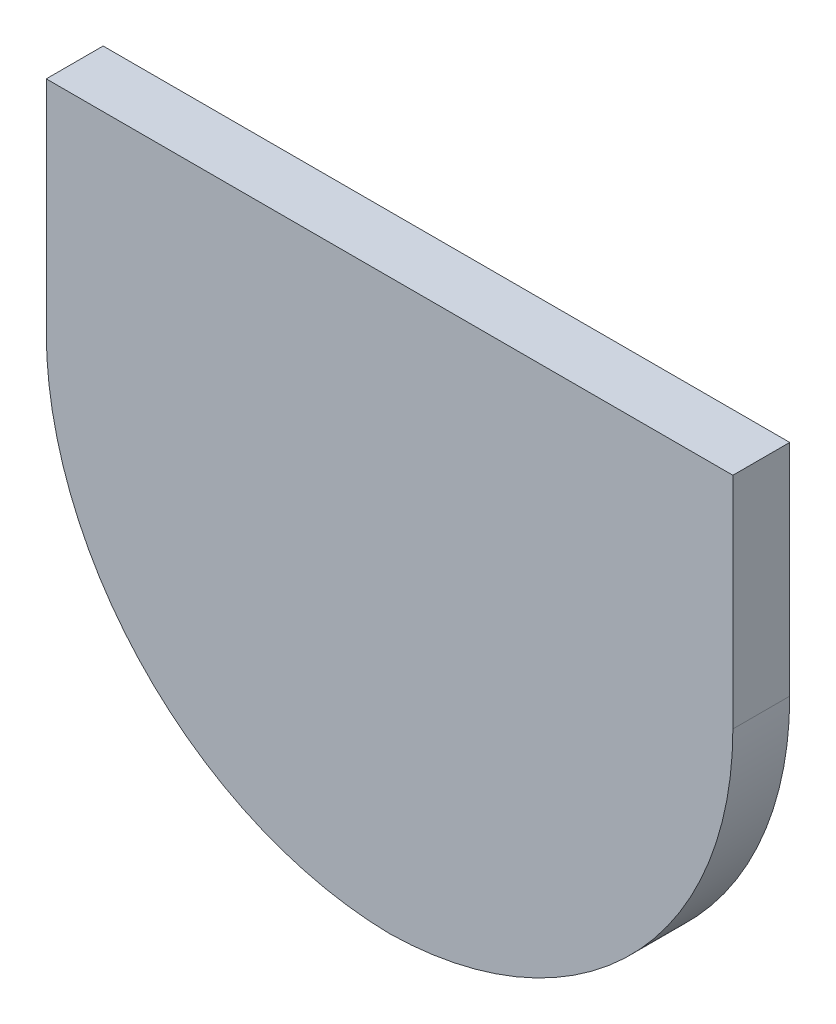
ISO-10303-21;
HEADER;
FILE_DESCRIPTION(('STEP AP214'),'2;1');
FILE_NAME('part.step','',(''),(''),'','','');
FILE_SCHEMA(('AUTOMOTIVE_DESIGN { 1 0 10303 214 1 1 1 1 }'));
ENDSEC;
DATA;
#1=APPLICATION_CONTEXT('core data for automotive mechanical design processes');
#2=APPLICATION_PROTOCOL_DEFINITION('international standard','automotive_design',2000,#1);
#3=PRODUCT_CONTEXT('',#1,'mechanical');
#4=PRODUCT('Part','Part','',(#3));
#5=PRODUCT_RELATED_PRODUCT_CATEGORY('part','',(#4));
#6=PRODUCT_DEFINITION_FORMATION('','',#4);
#7=PRODUCT_DEFINITION_CONTEXT('part definition',#1,'design');
#8=PRODUCT_DEFINITION('design','',#6,#7);
#9=PRODUCT_DEFINITION_SHAPE('','',#8);
#10=(LENGTH_UNIT() NAMED_UNIT(*) SI_UNIT(.MILLI.,.METRE.));
#11=(NAMED_UNIT(*) PLANE_ANGLE_UNIT() SI_UNIT($,.RADIAN.));
#12=(NAMED_UNIT(*) SI_UNIT($,.STERADIAN.) SOLID_ANGLE_UNIT());
#13=UNCERTAINTY_MEASURE_WITH_UNIT(LENGTH_MEASURE(1.E-05),#10,'distance_accuracy_value','');
#14=(GEOMETRIC_REPRESENTATION_CONTEXT(3) GLOBAL_UNCERTAINTY_ASSIGNED_CONTEXT((#13)) GLOBAL_UNIT_ASSIGNED_CONTEXT((#10,
#11,#12)) REPRESENTATION_CONTEXT('',''));
#15=CARTESIAN_POINT('',(0.,0.,0.));
#16=DIRECTION('',(0.,0.,1.));
#17=DIRECTION('',(1.,0.,0.));
#18=AXIS2_PLACEMENT_3D('',#15,#16,#17);
#19=CARTESIAN_POINT('',(9.02657829790189,11.2,2.2));
#20=DIRECTION('',(-1.,0.,0.));
#21=DIRECTION('',(0.,0.,1.));
#22=AXIS2_PLACEMENT_3D('',#19,#20,#21);
#23=PLANE('',#22);
#24=DIRECTION('',(0.,1.,0.));
#25=VECTOR('',#24,1.);
#26=CARTESIAN_POINT('',(9.02657829790189,11.2,2.2));
#27=LINE('',#26,#25);
#28=CARTESIAN_POINT('',(9.02657829790189,2.7,2.2));
#29=VERTEX_POINT('',#28);
#30=CARTESIAN_POINT('',(9.02657829790189,11.2,2.2));
#31=VERTEX_POINT('',#30);
#32=EDGE_CURVE('E81',#29,#31,#27,.T.);
#33=ORIENTED_EDGE('',*,*,#32,.F.);
#34=DIRECTION('',(0.,0.,-1.));
#35=VECTOR('',#34,1.);
#36=CARTESIAN_POINT('',(9.02657829790189,2.7,2.2));
#37=LINE('',#36,#35);
#38=CARTESIAN_POINT('',(9.02657829790189,2.7,0.));
#39=VERTEX_POINT('',#38);
#40=EDGE_CURVE('E104',#29,#39,#37,.T.);
#41=ORIENTED_EDGE('',*,*,#40,.T.);
#42=DIRECTION('',(0.,1.,0.));
#43=VECTOR('',#42,1.);
#44=CARTESIAN_POINT('',(9.02657829790189,11.2,0.));
#45=LINE('',#44,#43);
#46=CARTESIAN_POINT('',(9.02657829790189,11.2,0.));
#47=VERTEX_POINT('',#46);
#48=EDGE_CURVE('E102',#39,#47,#45,.T.);
#49=ORIENTED_EDGE('',*,*,#48,.T.);
#50=DIRECTION('',(0.,0.,-1.));
#51=VECTOR('',#50,1.);
#52=CARTESIAN_POINT('',(9.02657829790189,11.2,2.2));
#53=LINE('',#52,#51);
#54=EDGE_CURVE('E96',#31,#47,#53,.T.);
#55=ORIENTED_EDGE('',*,*,#54,.F.);
#56=EDGE_LOOP('',(#33,#41,#49,#55));
#57=FACE_BOUND('',#56,.T.);
#58=ADVANCED_FACE('F35',(#57),#23,.F.);
#59=CARTESIAN_POINT('',(-17.5334217020981,11.2,2.2));
#60=DIRECTION('',(0.,-1.,0.));
#61=DIRECTION('',(0.,0.,-1.));
#62=AXIS2_PLACEMENT_3D('',#59,#60,#61);
#63=PLANE('',#62);
#64=DIRECTION('',(-1.,0.,0.));
#65=VECTOR('',#64,1.);
#66=CARTESIAN_POINT('',(-17.5334217020981,11.2,0.));
#67=LINE('',#66,#65);
#68=CARTESIAN_POINT('',(-17.5334217020981,11.2,0.));
#69=VERTEX_POINT('',#68);
#70=EDGE_CURVE('E123',#47,#69,#67,.T.);
#71=ORIENTED_EDGE('',*,*,#70,.T.);
#72=DIRECTION('',(0.,0.,-1.));
#73=VECTOR('',#72,1.);
#74=CARTESIAN_POINT('',(-17.5334217020981,11.2,2.2));
#75=LINE('',#74,#73);
#76=CARTESIAN_POINT('',(-17.5334217020981,11.2,2.2));
#77=VERTEX_POINT('',#76);
#78=EDGE_CURVE('E98',#77,#69,#75,.T.);
#79=ORIENTED_EDGE('',*,*,#78,.F.);
#80=DIRECTION('',(-1.,0.,0.));
#81=VECTOR('',#80,1.);
#82=CARTESIAN_POINT('',(-17.5334217020981,11.2,2.2));
#83=LINE('',#82,#81);
#84=EDGE_CURVE('E84',#31,#77,#83,.T.);
#85=ORIENTED_EDGE('',*,*,#84,.F.);
#86=ORIENTED_EDGE('',*,*,#54,.T.);
#87=EDGE_LOOP('',(#71,#79,#85,#86));
#88=FACE_BOUND('',#87,.T.);
#89=ADVANCED_FACE('F95',(#88),#63,.F.);
#90=CARTESIAN_POINT('',(-17.5334217020981,11.2,2.2));
#91=DIRECTION('',(1.,0.,0.));
#92=DIRECTION('',(0.,0.,-1.));
#93=AXIS2_PLACEMENT_3D('',#90,#91,#92);
#94=PLANE('',#93);
#95=DIRECTION('',(0.,-1.,0.));
#96=VECTOR('',#95,1.);
#97=CARTESIAN_POINT('',(-17.5334217020981,11.2,0.));
#98=LINE('',#97,#96);
#99=CARTESIAN_POINT('',(-17.5334217020981,2.7,0.));
#100=VERTEX_POINT('',#99);
#101=EDGE_CURVE('E91',#69,#100,#98,.T.);
#102=ORIENTED_EDGE('',*,*,#101,.T.);
#103=DIRECTION('',(0.,0.,-1.));
#104=VECTOR('',#103,1.);
#105=CARTESIAN_POINT('',(-17.5334217020981,2.7,2.2));
#106=LINE('',#105,#104);
#107=CARTESIAN_POINT('',(-17.5334217020981,2.7,2.2));
#108=VERTEX_POINT('',#107);
#109=EDGE_CURVE('E11',#100,#108,#106,.F.);
#110=ORIENTED_EDGE('',*,*,#109,.T.);
#111=DIRECTION('',(0.,-1.,0.));
#112=VECTOR('',#111,1.);
#113=CARTESIAN_POINT('',(-17.5334217020981,11.2,2.2));
#114=LINE('',#113,#112);
#115=EDGE_CURVE('E99',#77,#108,#114,.T.);
#116=ORIENTED_EDGE('',*,*,#115,.F.);
#117=ORIENTED_EDGE('',*,*,#78,.T.);
#118=EDGE_LOOP('',(#102,#110,#116,#117));
#119=FACE_BOUND('',#118,.T.);
#120=ADVANCED_FACE('F127',(#119),#94,.F.);
#121=CARTESIAN_POINT('',(0.,0.,2.2));
#122=DIRECTION('',(0.,0.,1.));
#123=DIRECTION('',(1.,0.,0.));
#124=AXIS2_PLACEMENT_3D('',#121,#122,#123);
#125=PLANE('',#124);
#126=CARTESIAN_POINT('',(-4.03342170209812,2.7,2.2));
#127=DIRECTION('',(0.,0.,1.));
#128=DIRECTION('',(1.,0.,0.));
#129=AXIS2_PLACEMENT_3D('',#126,#127,#128);
#130=CIRCLE('',#129,13.5);
#131=CARTESIAN_POINT('',(-4.25342170209811,-10.7982072883772,2.2));
#132=VERTEX_POINT('',#131);
#133=EDGE_CURVE('E51',#108,#132,#130,.T.);
#134=ORIENTED_EDGE('',*,*,#133,.T.);
#135=CARTESIAN_POINT('',(-4.47342170209811,2.7,2.2));
#136=DIRECTION('',(0.,0.,1.));
#137=DIRECTION('',(1.,0.,0.));
#138=AXIS2_PLACEMENT_3D('',#135,#136,#137);
#139=CIRCLE('',#138,13.5);
#140=EDGE_CURVE('E44',#132,#29,#139,.T.);
#141=ORIENTED_EDGE('',*,*,#140,.T.);
#142=ORIENTED_EDGE('',*,*,#32,.T.);
#143=ORIENTED_EDGE('',*,*,#84,.T.);
#144=ORIENTED_EDGE('',*,*,#115,.T.);
#145=EDGE_LOOP('',(#134,#141,#142,#143,#144));
#146=FACE_BOUND('',#145,.T.);
#147=ADVANCED_FACE('F83',(#146),#125,.T.);
#148=CARTESIAN_POINT('',(0.,0.,0.));
#149=DIRECTION('',(0.,0.,1.));
#150=DIRECTION('',(1.,0.,0.));
#151=AXIS2_PLACEMENT_3D('',#148,#149,#150);
#152=PLANE('',#151);
#153=ORIENTED_EDGE('',*,*,#48,.F.);
#154=CARTESIAN_POINT('',(-4.47342170209811,2.7,0.));
#155=DIRECTION('',(0.,0.,1.));
#156=DIRECTION('',(1.,0.,0.));
#157=AXIS2_PLACEMENT_3D('',#154,#155,#156);
#158=CIRCLE('',#157,13.5);
#159=CARTESIAN_POINT('',(-4.25342170209811,-10.7982072883772,0.));
#160=VERTEX_POINT('',#159);
#161=EDGE_CURVE('E112',#39,#160,#158,.F.);
#162=ORIENTED_EDGE('',*,*,#161,.T.);
#163=CARTESIAN_POINT('',(-4.03342170209812,2.7,0.));
#164=DIRECTION('',(0.,0.,1.));
#165=DIRECTION('',(1.,0.,0.));
#166=AXIS2_PLACEMENT_3D('',#163,#164,#165);
#167=CIRCLE('',#166,13.5);
#168=EDGE_CURVE('E106',#160,#100,#167,.F.);
#169=ORIENTED_EDGE('',*,*,#168,.T.);
#170=ORIENTED_EDGE('',*,*,#101,.F.);
#171=ORIENTED_EDGE('',*,*,#70,.F.);
#172=EDGE_LOOP('',(#153,#162,#169,#170,#171));
#173=FACE_BOUND('',#172,.T.);
#174=ADVANCED_FACE('F117',(#173),#152,.F.);
#175=CARTESIAN_POINT('',(-4.03342170209812,2.7,2.2));
#176=DIRECTION('',(0.,0.,-1.));
#177=DIRECTION('',(-1.,0.,0.));
#178=AXIS2_PLACEMENT_3D('',#175,#176,#177);
#179=CYLINDRICAL_SURFACE('',#178,13.5);
#180=DIRECTION('',(0.,0.,-1.));
#181=VECTOR('',#180,1.);
#182=CARTESIAN_POINT('',(-4.25342170209811,-10.7982072883772,1.1));
#183=LINE('',#182,#181);
#184=EDGE_CURVE('E39',#132,#160,#183,.T.);
#185=ORIENTED_EDGE('',*,*,#184,.F.);
#186=ORIENTED_EDGE('',*,*,#133,.F.);
#187=ORIENTED_EDGE('',*,*,#109,.F.);
#188=ORIENTED_EDGE('',*,*,#168,.F.);
#189=EDGE_LOOP('',(#185,#186,#187,#188));
#190=FACE_BOUND('',#189,.T.);
#191=ADVANCED_FACE('F37',(#190),#179,.T.);
#192=CARTESIAN_POINT('',(-4.47342170209811,2.7,2.2));
#193=DIRECTION('',(0.,0.,-1.));
#194=DIRECTION('',(-1.,0.,0.));
#195=AXIS2_PLACEMENT_3D('',#192,#193,#194);
#196=CYLINDRICAL_SURFACE('',#195,13.5);
#197=ORIENTED_EDGE('',*,*,#140,.F.);
#198=ORIENTED_EDGE('',*,*,#184,.T.);
#199=ORIENTED_EDGE('',*,*,#161,.F.);
#200=ORIENTED_EDGE('',*,*,#40,.F.);
#201=EDGE_LOOP('',(#197,#198,#199,#200));
#202=FACE_BOUND('',#201,.T.);
#203=ADVANCED_FACE('F122',(#202),#196,.T.);
#204=CLOSED_SHELL('',(#58,#89,#120,#147,#174,#191,#203));
#205=MANIFOLD_SOLID_BREP('B2',#204);
#206=ADVANCED_BREP_SHAPE_REPRESENTATION('',(#18,#205),#14);
#207=SHAPE_DEFINITION_REPRESENTATION(#9,#206);
ENDSEC;
END-ISO-10303-21;
